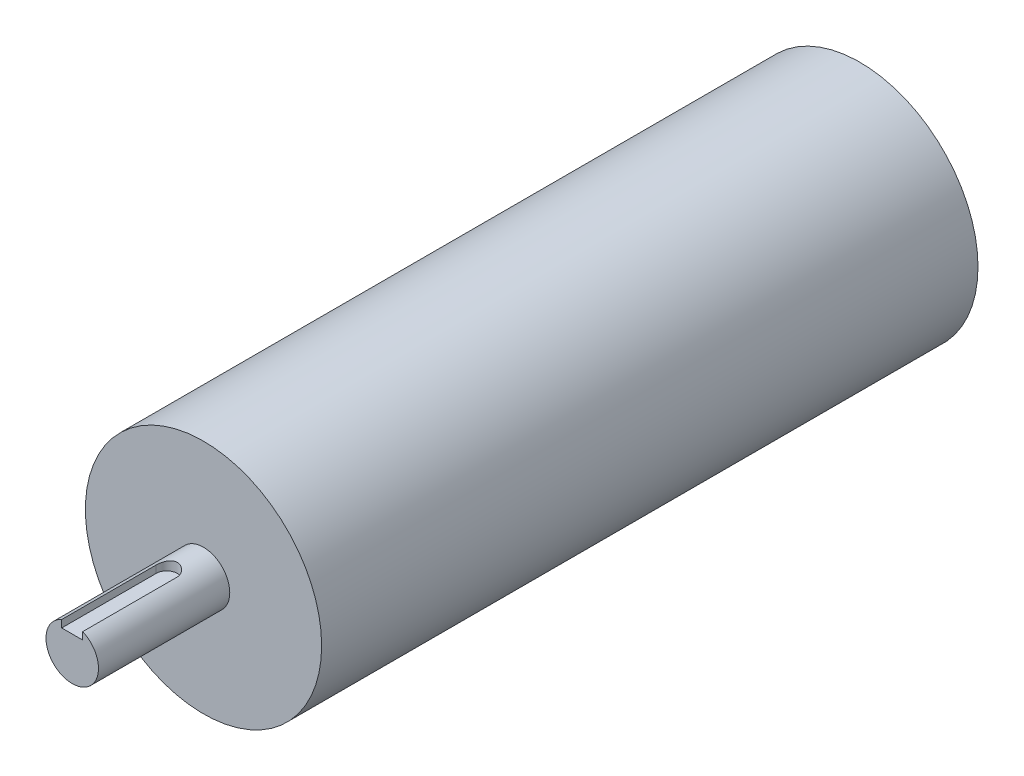
ISO-10303-21;
HEADER;
FILE_DESCRIPTION(('STEP AP214'),'2;1');
FILE_NAME('part.step','',(''),(''),'','','');
FILE_SCHEMA(('AUTOMOTIVE_DESIGN { 1 0 10303 214 1 1 1 1 }'));
ENDSEC;
DATA;
#1=APPLICATION_CONTEXT('core data for automotive mechanical design processes');
#2=APPLICATION_PROTOCOL_DEFINITION('international standard','automotive_design',2000,#1);
#3=PRODUCT_CONTEXT('',#1,'mechanical');
#4=PRODUCT('Part','Part','',(#3));
#5=PRODUCT_RELATED_PRODUCT_CATEGORY('part','',(#4));
#6=PRODUCT_DEFINITION_FORMATION('','',#4);
#7=PRODUCT_DEFINITION_CONTEXT('part definition',#1,'design');
#8=PRODUCT_DEFINITION('design','',#6,#7);
#9=PRODUCT_DEFINITION_SHAPE('','',#8);
#10=(LENGTH_UNIT() NAMED_UNIT(*) SI_UNIT(.MILLI.,.METRE.));
#11=(NAMED_UNIT(*) PLANE_ANGLE_UNIT() SI_UNIT($,.RADIAN.));
#12=(NAMED_UNIT(*) SI_UNIT($,.STERADIAN.) SOLID_ANGLE_UNIT());
#13=UNCERTAINTY_MEASURE_WITH_UNIT(LENGTH_MEASURE(1.E-05),#10,'distance_accuracy_value','');
#14=(GEOMETRIC_REPRESENTATION_CONTEXT(3) GLOBAL_UNCERTAINTY_ASSIGNED_CONTEXT((#13)) GLOBAL_UNIT_ASSIGNED_CONTEXT((#10,
#11,#12)) REPRESENTATION_CONTEXT('',''));
#15=CARTESIAN_POINT('',(0.,0.,0.));
#16=DIRECTION('',(0.,0.,1.));
#17=DIRECTION('',(1.,0.,0.));
#18=AXIS2_PLACEMENT_3D('',#15,#16,#17);
#19=CARTESIAN_POINT('',(0.,3.18495417836395,132.));
#20=DIRECTION('',(0.,-1.,0.));
#21=DIRECTION('',(0.,0.,-1.));
#22=AXIS2_PLACEMENT_3D('',#19,#20,#21);
#23=CYLINDRICAL_SURFACE('',#22,2.);
#24=DIRECTION('',(0.,-1.,0.));
#25=VECTOR('',#24,1.);
#26=CARTESIAN_POINT('',(-2.,3.18495417836395,132.));
#27=LINE('',#26,#25);
#28=CARTESIAN_POINT('',(-2.,3.18495417836395,132.));
#29=VERTEX_POINT('',#28);
#30=CARTESIAN_POINT('',(-2.,4.58257569495584,132.));
#31=VERTEX_POINT('',#30);
#32=EDGE_CURVE('E134',#29,#31,#27,.F.);
#33=ORIENTED_EDGE('',*,*,#32,.F.);
#34=CARTESIAN_POINT('',(0.,3.18495417836395,132.));
#35=DIRECTION('',(0.,-1.,0.));
#36=DIRECTION('',(0.,0.,-1.));
#37=AXIS2_PLACEMENT_3D('',#34,#35,#36);
#38=CIRCLE('',#37,2.);
#39=CARTESIAN_POINT('',(2.,3.18495417836395,132.));
#40=VERTEX_POINT('',#39);
#41=EDGE_CURVE('E60',#40,#29,#38,.F.);
#42=ORIENTED_EDGE('',*,*,#41,.F.);
#43=DIRECTION('',(0.,-1.,0.));
#44=VECTOR('',#43,1.);
#45=CARTESIAN_POINT('',(2.,3.18495417836395,132.));
#46=LINE('',#45,#44);
#47=CARTESIAN_POINT('',(2.,4.58257569495584,132.));
#48=VERTEX_POINT('',#47);
#49=EDGE_CURVE('E97',#48,#40,#46,.T.);
#50=ORIENTED_EDGE('',*,*,#49,.F.);
#51=CARTESIAN_POINT('',(-2.,4.58257569495584,132.));
#52=CARTESIAN_POINT('',(-2.00000798074523,4.58256464460308,131.946194023836));
#53=CARTESIAN_POINT('',(-1.99782890382977,4.5835230651295,131.892394087044));
#54=CARTESIAN_POINT('',(-1.98915900979768,4.58729627580301,131.785228209973));
#55=CARTESIAN_POINT('',(-1.98266983488182,4.59011035891672,131.731862112231));
#56=CARTESIAN_POINT('',(-1.96547591856769,4.59749787986371,131.626152573095));
#57=CARTESIAN_POINT('',(-1.95478786090697,4.60206435314848,131.573805934586));
#58=CARTESIAN_POINT('',(-1.92931623236441,4.61280056153232,131.4702989911));
#59=CARTESIAN_POINT('',(-1.91453241157164,4.61897039446206,131.419138758721));
#60=CARTESIAN_POINT('',(-1.86426933982564,4.63959307095438,131.268062990899));
#61=CARTESIAN_POINT('',(-1.82284398117318,4.65617487498139,131.170343520696));
#62=CARTESIAN_POINT('',(-1.72548058075419,4.69312417766962,130.983202347924));
#63=CARTESIAN_POINT('',(-1.6695290750006,4.71349518347091,130.893788448571));
#64=CARTESIAN_POINT('',(-1.5413234915418,4.75700831106819,130.720744322228));
#65=CARTESIAN_POINT('',(-1.46838082176944,4.78023894977214,130.637645423839));
#66=CARTESIAN_POINT('',(-1.30970879203937,4.82612446866979,130.484470266119));
#67=CARTESIAN_POINT('',(-1.22397489043549,4.84877914100377,130.414398652177));
#68=CARTESIAN_POINT('',(-1.0379685135445,4.89204347548508,130.286566465055));
#69=CARTESIAN_POINT('',(-0.937252664377253,4.91253558832281,130.229408131726));
#70=CARTESIAN_POINT('',(-0.726721666691695,4.94805210037378,130.133121661485));
#71=CARTESIAN_POINT('',(-0.61691812783697,4.96308334748397,130.093970926624));
#72=CARTESIAN_POINT('',(-0.422275332869854,4.98282067135847,130.043248805532));
#73=CARTESIAN_POINT('',(-0.338781376508079,4.98922385410562,130.027070225134));
#74=CARTESIAN_POINT('',(-0.170200792783044,4.99781460343099,130.005444784104));
#75=CARTESIAN_POINT('',(-0.0851143458337797,5.00000264466038,129.999996715147));
#76=CARTESIAN_POINT('',(0.107681313204995,4.99999665414215,130.000004155789));
#77=CARTESIAN_POINT('',(0.215407280577217,4.99648695827206,130.008733594643));
#78=CARTESIAN_POINT('',(0.427680802252588,4.98281350615419,130.043300125871));
#79=CARTESIAN_POINT('',(0.532225906679354,4.97264475044557,130.069150072074));
#80=CARTESIAN_POINT('',(0.734934339641888,4.94674560097181,130.136867195692));
#81=CARTESIAN_POINT('',(0.833113116469265,4.93102931598793,130.17869376245));
#82=CARTESIAN_POINT('',(1.02102557669093,4.89557588170001,130.276991112008));
#83=CARTESIAN_POINT('',(1.11075797876765,4.87583812376992,130.333464111813));
#84=CARTESIAN_POINT('',(1.28350336426501,4.83330843124055,130.462236752122));
#85=CARTESIAN_POINT('',(1.36606584613657,4.81042207341105,130.535109203775));
#86=CARTESIAN_POINT('',(1.51817804014667,4.76460467541499,130.693404333933));
#87=CARTESIAN_POINT('',(1.58772195306072,4.74167361991138,130.778832575411));
#88=CARTESIAN_POINT('',(1.71490216816057,4.69721845761247,130.964466702533));
#89=CARTESIAN_POINT('',(1.77186217229292,4.67580402804856,131.065164445212));
#90=CARTESIAN_POINT('',(1.86779093367616,4.63832101022988,131.275641369551));
#91=CARTESIAN_POINT('',(1.90678371186201,4.62224529256993,131.385408193438));
#92=CARTESIAN_POINT('',(1.95713137456959,4.60110666869269,131.579606356061));
#93=CARTESIAN_POINT('',(1.97314611876911,4.59422807075555,131.66265645531));
#94=CARTESIAN_POINT('',(1.99460561120647,4.58493016864862,131.830444831107));
#95=CARTESIAN_POINT('',(2.0000384948766,4.58251587008298,131.915184895098));
#96=CARTESIAN_POINT('',(2.,4.58257569495584,132.));
#97=B_SPLINE_CURVE_WITH_KNOTS('',3,(#51,#52,#53,#54,#55,#56,#57,#58,#59,#60,#61,#62,#63,#64,#65,
#66,#67,#68,#69,#70,#71,#72,#73,#74,#75,#76,#77,#78,#79,#80,#81,#82,#83,#84,#85,#86,#87,#88,#89,
#90,#91,#92,#93,#94,#95,#96),.UNSPECIFIED.,.F.,.F.,(4,2,2,2,2,2,2,2,2,2,2,2,2,2,2,2,2,2,2,2,2,2,
4),(0.,0.161355223890516,0.322649004679312,0.483308283322199,0.643977367062373,
0.964686694551775,1.28569434882194,1.62315502394645,1.96073580403936,2.31177614925888,
2.66237475977224,2.9174908864907,3.17257828386527,3.495298803682,3.81826189245767,
4.14040945265618,4.46260580424014,4.79855936163858,5.13466221793406,5.48588284100888,
5.83663253426735,6.09045371289731,6.34455931683462),.UNSPECIFIED.);
#98=EDGE_CURVE('E11',#48,#31,#97,.F.);
#99=ORIENTED_EDGE('',*,*,#98,.T.);
#100=EDGE_LOOP('',(#33,#42,#50,#99));
#101=FACE_BOUND('',#100,.T.);
#102=ADVANCED_FACE('F45',(#101),#23,.F.);
#103=CARTESIAN_POINT('',(0.,0.,125.));
#104=DIRECTION('',(0.,0.,-1.));
#105=DIRECTION('',(-1.,0.,0.));
#106=AXIS2_PLACEMENT_3D('',#103,#104,#105);
#107=CYLINDRICAL_SURFACE('',#106,22.5);
#108=CARTESIAN_POINT('',(0.,0.,125.));
#109=DIRECTION('',(0.,0.,1.));
#110=DIRECTION('',(1.,0.,0.));
#111=AXIS2_PLACEMENT_3D('',#108,#109,#110);
#112=CIRCLE('',#111,22.5);
#113=CARTESIAN_POINT('',(22.5,0.,125.));
#114=VERTEX_POINT('',#113);
#115=EDGE_CURVE('E135',#114,#114,#112,.T.);
#116=ORIENTED_EDGE('',*,*,#115,.F.);
#117=EDGE_LOOP('',(#116));
#118=FACE_BOUND('',#117,.T.);
#119=CARTESIAN_POINT('',(0.,0.,0.));
#120=DIRECTION('',(0.,0.,1.));
#121=DIRECTION('',(1.,0.,0.));
#122=AXIS2_PLACEMENT_3D('',#119,#120,#121);
#123=CIRCLE('',#122,22.5);
#124=CARTESIAN_POINT('',(22.5,0.,0.));
#125=VERTEX_POINT('',#124);
#126=EDGE_CURVE('E129',#125,#125,#123,.T.);
#127=ORIENTED_EDGE('',*,*,#126,.T.);
#128=EDGE_LOOP('',(#127));
#129=FACE_BOUND('',#128,.T.);
#130=ADVANCED_FACE('F159',(#118,#129),#107,.T.);
#131=CARTESIAN_POINT('',(0.,0.,125.));
#132=DIRECTION('',(0.,0.,1.));
#133=DIRECTION('',(1.,0.,0.));
#134=AXIS2_PLACEMENT_3D('',#131,#132,#133);
#135=PLANE('',#134);
#136=CARTESIAN_POINT('',(0.,0.,125.));
#137=DIRECTION('',(0.,0.,1.));
#138=DIRECTION('',(1.,0.,0.));
#139=AXIS2_PLACEMENT_3D('',#136,#137,#138);
#140=CIRCLE('',#139,5.);
#141=CARTESIAN_POINT('',(5.,0.,125.));
#142=VERTEX_POINT('',#141);
#143=EDGE_CURVE('E130',#142,#142,#140,.T.);
#144=ORIENTED_EDGE('',*,*,#143,.F.);
#145=EDGE_LOOP('',(#144));
#146=FACE_BOUND('',#145,.T.);
#147=ORIENTED_EDGE('',*,*,#115,.T.);
#148=EDGE_LOOP('',(#147));
#149=FACE_BOUND('',#148,.T.);
#150=ADVANCED_FACE('F156',(#146,#149),#135,.T.);
#151=CARTESIAN_POINT('',(0.,0.,0.));
#152=DIRECTION('',(0.,0.,1.));
#153=DIRECTION('',(1.,0.,0.));
#154=AXIS2_PLACEMENT_3D('',#151,#152,#153);
#155=PLANE('',#154);
#156=ORIENTED_EDGE('',*,*,#126,.F.);
#157=EDGE_LOOP('',(#156));
#158=FACE_BOUND('',#157,.T.);
#159=ADVANCED_FACE('F153',(#158),#155,.F.);
#160=CARTESIAN_POINT('',(0.,0.,150.));
#161=DIRECTION('',(0.,0.,-1.));
#162=DIRECTION('',(-1.,0.,0.));
#163=AXIS2_PLACEMENT_3D('',#160,#161,#162);
#164=CYLINDRICAL_SURFACE('',#163,5.);
#165=ORIENTED_EDGE('',*,*,#98,.F.);
#166=DIRECTION('',(0.,0.,1.));
#167=VECTOR('',#166,1.);
#168=CARTESIAN_POINT('',(2.,4.58257569495584,130.));
#169=LINE('',#168,#167);
#170=CARTESIAN_POINT('',(2.,4.58257569495584,150.));
#171=VERTEX_POINT('',#170);
#172=EDGE_CURVE('E100',#48,#171,#169,.T.);
#173=ORIENTED_EDGE('',*,*,#172,.T.);
#174=CARTESIAN_POINT('',(0.,0.,150.));
#175=DIRECTION('',(0.,0.,1.));
#176=DIRECTION('',(1.,0.,0.));
#177=AXIS2_PLACEMENT_3D('',#174,#175,#176);
#178=CIRCLE('',#177,5.);
#179=CARTESIAN_POINT('',(-2.,4.58257569495584,150.));
#180=VERTEX_POINT('',#179);
#181=EDGE_CURVE('E115',#180,#171,#178,.T.);
#182=ORIENTED_EDGE('',*,*,#181,.F.);
#183=DIRECTION('',(0.,0.,1.));
#184=VECTOR('',#183,1.);
#185=CARTESIAN_POINT('',(-2.,4.58257569495584,130.));
#186=LINE('',#185,#184);
#187=EDGE_CURVE('E122',#31,#180,#186,.T.);
#188=ORIENTED_EDGE('',*,*,#187,.F.);
#189=EDGE_LOOP('',(#165,#173,#182,#188));
#190=FACE_BOUND('',#189,.T.);
#191=ORIENTED_EDGE('',*,*,#143,.T.);
#192=EDGE_LOOP('',(#191));
#193=FACE_BOUND('',#192,.T.);
#194=ADVANCED_FACE('F150',(#190,#193),#164,.T.);
#195=CARTESIAN_POINT('',(0.,0.,150.));
#196=DIRECTION('',(0.,0.,1.));
#197=DIRECTION('',(1.,0.,0.));
#198=AXIS2_PLACEMENT_3D('',#195,#196,#197);
#199=PLANE('',#198);
#200=DIRECTION('',(0.,-1.,0.));
#201=VECTOR('',#200,1.);
#202=CARTESIAN_POINT('',(-2.,3.18495417836395,150.));
#203=LINE('',#202,#201);
#204=CARTESIAN_POINT('',(-2.,3.18495417836395,150.));
#205=VERTEX_POINT('',#204);
#206=EDGE_CURVE('E111',#180,#205,#203,.T.);
#207=ORIENTED_EDGE('',*,*,#206,.F.);
#208=ORIENTED_EDGE('',*,*,#181,.T.);
#209=DIRECTION('',(0.,1.,0.));
#210=VECTOR('',#209,1.);
#211=CARTESIAN_POINT('',(2.,3.18495417836395,150.));
#212=LINE('',#211,#210);
#213=CARTESIAN_POINT('',(2.,3.18495417836395,150.));
#214=VERTEX_POINT('',#213);
#215=EDGE_CURVE('E95',#214,#171,#212,.T.);
#216=ORIENTED_EDGE('',*,*,#215,.F.);
#217=DIRECTION('',(1.,0.,0.));
#218=VECTOR('',#217,1.);
#219=CARTESIAN_POINT('',(-2.,3.18495417836395,150.));
#220=LINE('',#219,#218);
#221=EDGE_CURVE('E104',#205,#214,#220,.T.);
#222=ORIENTED_EDGE('',*,*,#221,.F.);
#223=EDGE_LOOP('',(#207,#208,#216,#222));
#224=FACE_BOUND('',#223,.T.);
#225=ADVANCED_FACE('F113',(#224),#199,.T.);
#226=CARTESIAN_POINT('',(-2.,3.18495417836395,130.));
#227=DIRECTION('',(-1.,0.,0.));
#228=DIRECTION('',(0.,0.,1.));
#229=AXIS2_PLACEMENT_3D('',#226,#227,#228);
#230=PLANE('',#229);
#231=DIRECTION('',(0.,0.,1.));
#232=VECTOR('',#231,1.);
#233=CARTESIAN_POINT('',(-2.,3.18495417836395,130.));
#234=LINE('',#233,#232);
#235=EDGE_CURVE('E101',#29,#205,#234,.T.);
#236=ORIENTED_EDGE('',*,*,#235,.F.);
#237=ORIENTED_EDGE('',*,*,#32,.T.);
#238=ORIENTED_EDGE('',*,*,#187,.T.);
#239=ORIENTED_EDGE('',*,*,#206,.T.);
#240=EDGE_LOOP('',(#236,#237,#238,#239));
#241=FACE_BOUND('',#240,.T.);
#242=ADVANCED_FACE('F148',(#241),#230,.F.);
#243=CARTESIAN_POINT('',(2.,3.18495417836395,130.));
#244=DIRECTION('',(1.,0.,0.));
#245=DIRECTION('',(0.,0.,-1.));
#246=AXIS2_PLACEMENT_3D('',#243,#244,#245);
#247=PLANE('',#246);
#248=ORIENTED_EDGE('',*,*,#172,.F.);
#249=ORIENTED_EDGE('',*,*,#49,.T.);
#250=DIRECTION('',(0.,0.,1.));
#251=VECTOR('',#250,1.);
#252=CARTESIAN_POINT('',(2.,3.18495417836395,130.));
#253=LINE('',#252,#251);
#254=EDGE_CURVE('E90',#40,#214,#253,.T.);
#255=ORIENTED_EDGE('',*,*,#254,.T.);
#256=ORIENTED_EDGE('',*,*,#215,.T.);
#257=EDGE_LOOP('',(#248,#249,#255,#256));
#258=FACE_BOUND('',#257,.T.);
#259=ADVANCED_FACE('F93',(#258),#247,.F.);
#260=CARTESIAN_POINT('',(-2.,3.18495417836395,130.));
#261=DIRECTION('',(0.,-1.,0.));
#262=DIRECTION('',(0.,0.,-1.));
#263=AXIS2_PLACEMENT_3D('',#260,#261,#262);
#264=PLANE('',#263);
#265=ORIENTED_EDGE('',*,*,#254,.F.);
#266=ORIENTED_EDGE('',*,*,#41,.T.);
#267=ORIENTED_EDGE('',*,*,#235,.T.);
#268=ORIENTED_EDGE('',*,*,#221,.T.);
#269=EDGE_LOOP('',(#265,#266,#267,#268));
#270=FACE_BOUND('',#269,.T.);
#271=ADVANCED_FACE('F105',(#270),#264,.F.);
#272=CLOSED_SHELL('',(#102,#130,#150,#159,#194,#225,#242,#259,#271));
#273=MANIFOLD_SOLID_BREP('B2',#272);
#274=ADVANCED_BREP_SHAPE_REPRESENTATION('',(#18,#273),#14);
#275=SHAPE_DEFINITION_REPRESENTATION(#9,#274);
ENDSEC;
END-ISO-10303-21;
